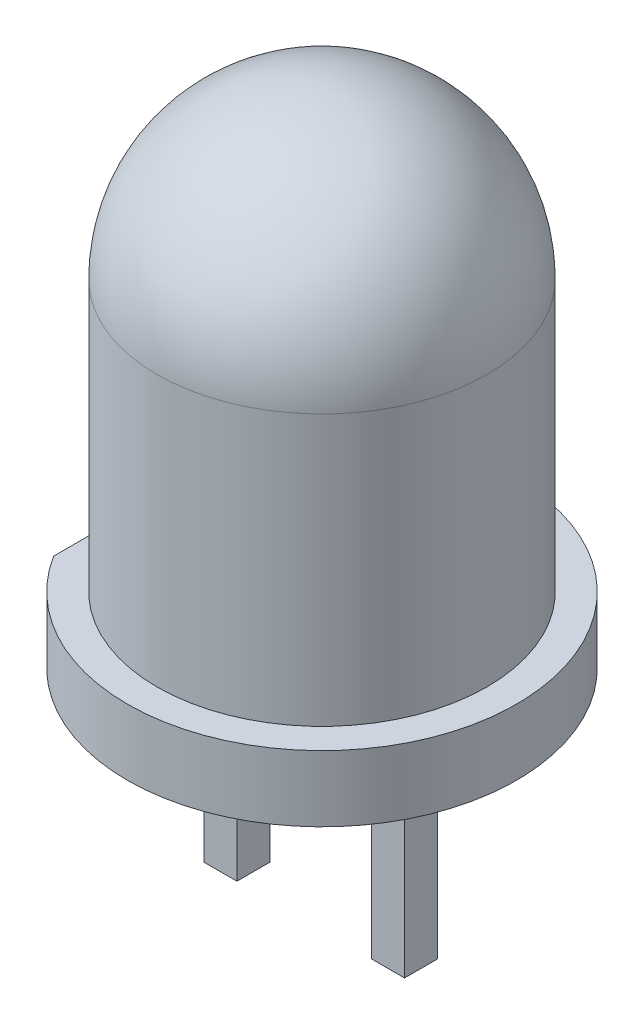
ISO-10303-21;
HEADER;
FILE_DESCRIPTION(('STEP AP214'),'2;1');
FILE_NAME('part.step','',(''),(''),'','','');
FILE_SCHEMA(('AUTOMOTIVE_DESIGN { 1 0 10303 214 1 1 1 1 }'));
ENDSEC;
DATA;
#1=APPLICATION_CONTEXT('core data for automotive mechanical design processes');
#2=APPLICATION_PROTOCOL_DEFINITION('international standard','automotive_design',2000,#1);
#3=PRODUCT_CONTEXT('',#1,'mechanical');
#4=PRODUCT('Part','Part','',(#3));
#5=PRODUCT_RELATED_PRODUCT_CATEGORY('part','',(#4));
#6=PRODUCT_DEFINITION_FORMATION('','',#4);
#7=PRODUCT_DEFINITION_CONTEXT('part definition',#1,'design');
#8=PRODUCT_DEFINITION('design','',#6,#7);
#9=PRODUCT_DEFINITION_SHAPE('','',#8);
#10=(LENGTH_UNIT() NAMED_UNIT(*) SI_UNIT(.MILLI.,.METRE.));
#11=(NAMED_UNIT(*) PLANE_ANGLE_UNIT() SI_UNIT($,.RADIAN.));
#12=(NAMED_UNIT(*) SI_UNIT($,.STERADIAN.) SOLID_ANGLE_UNIT());
#13=UNCERTAINTY_MEASURE_WITH_UNIT(LENGTH_MEASURE(1.E-05),#10,'distance_accuracy_value','');
#14=(GEOMETRIC_REPRESENTATION_CONTEXT(3) GLOBAL_UNCERTAINTY_ASSIGNED_CONTEXT((#13)) GLOBAL_UNIT_ASSIGNED_CONTEXT((#10,
#11,#12)) REPRESENTATION_CONTEXT('',''));
#15=CARTESIAN_POINT('',(0.,0.,0.));
#16=DIRECTION('',(0.,0.,1.));
#17=DIRECTION('',(1.,0.,0.));
#18=AXIS2_PLACEMENT_3D('',#15,#16,#17);
#19=CARTESIAN_POINT('',(0.,-919.589259581909,0.));
#20=DIRECTION('',(0.,-1.,0.));
#21=DIRECTION('',(0.,0.,-1.));
#22=AXIS2_PLACEMENT_3D('',#19,#20,#21);
#23=PLANE('',#22);
#24=DIRECTION('',(0.,0.,1.));
#25=VECTOR('',#24,1.);
#26=CARTESIAN_POINT('',(-2.5,-919.589259581909,0.));
#27=LINE('',#26,#25);
#28=CARTESIAN_POINT('',(-2.5,-919.589259581909,-1.56604597633658));
#29=VERTEX_POINT('',#28);
#30=CARTESIAN_POINT('',(-2.5,-919.589259581909,1.56604597633658));
#31=VERTEX_POINT('',#30);
#32=EDGE_CURVE('E186',#29,#31,#27,.T.);
#33=ORIENTED_EDGE('',*,*,#32,.F.);
#34=CARTESIAN_POINT('',(0.,-919.589259581909,0.));
#35=DIRECTION('',(0.,-1.,0.));
#36=DIRECTION('',(0.,0.,-1.));
#37=AXIS2_PLACEMENT_3D('',#34,#35,#36);
#38=CIRCLE('',#37,2.95);
#39=EDGE_CURVE('E11',#29,#31,#38,.T.);
#40=ORIENTED_EDGE('',*,*,#39,.T.);
#41=EDGE_LOOP('',(#33,#40));
#42=FACE_BOUND('',#41,.T.);
#43=DIRECTION('',(0.,0.,-1.));
#44=VECTOR('',#43,1.);
#45=CARTESIAN_POINT('',(1.02,-919.589259581909,-0.231185998967931));
#46=LINE('',#45,#44);
#47=CARTESIAN_POINT('',(1.02,-919.589259581909,0.268814001032069));
#48=VERTEX_POINT('',#47);
#49=CARTESIAN_POINT('',(1.02,-919.589259581909,-0.231185998967931));
#50=VERTEX_POINT('',#49);
#51=EDGE_CURVE('E146',#48,#50,#46,.T.);
#52=ORIENTED_EDGE('',*,*,#51,.F.);
#53=DIRECTION('',(-1.,0.,0.));
#54=VECTOR('',#53,1.);
#55=CARTESIAN_POINT('',(1.02,-919.589259581909,0.268814001032069));
#56=LINE('',#55,#54);
#57=CARTESIAN_POINT('',(1.52,-919.589259581909,0.268814001032069));
#58=VERTEX_POINT('',#57);
#59=EDGE_CURVE('E143',#58,#48,#56,.T.);
#60=ORIENTED_EDGE('',*,*,#59,.F.);
#61=DIRECTION('',(0.,0.,1.));
#62=VECTOR('',#61,1.);
#63=CARTESIAN_POINT('',(1.52,-919.589259581909,0.268814001032069));
#64=LINE('',#63,#62);
#65=CARTESIAN_POINT('',(1.52,-919.589259581909,-0.231185998967931));
#66=VERTEX_POINT('',#65);
#67=EDGE_CURVE('E152',#66,#58,#64,.T.);
#68=ORIENTED_EDGE('',*,*,#67,.F.);
#69=DIRECTION('',(1.,0.,0.));
#70=VECTOR('',#69,1.);
#71=CARTESIAN_POINT('',(1.52,-919.589259581909,-0.231185998967931));
#72=LINE('',#71,#70);
#73=EDGE_CURVE('E149',#50,#66,#72,.T.);
#74=ORIENTED_EDGE('',*,*,#73,.F.);
#75=EDGE_LOOP('',(#52,#60,#68,#74));
#76=FACE_BOUND('',#75,.T.);
#77=DIRECTION('',(-1.,0.,0.));
#78=VECTOR('',#77,1.);
#79=CARTESIAN_POINT('',(-1.52,-919.589259581909,0.268814001032069));
#80=LINE('',#79,#78);
#81=CARTESIAN_POINT('',(-1.02,-919.589259581909,0.268814001032069));
#82=VERTEX_POINT('',#81);
#83=CARTESIAN_POINT('',(-1.52,-919.589259581909,0.268814001032069));
#84=VERTEX_POINT('',#83);
#85=EDGE_CURVE('E196',#82,#84,#80,.T.);
#86=ORIENTED_EDGE('',*,*,#85,.F.);
#87=DIRECTION('',(0.,0.,1.));
#88=VECTOR('',#87,1.);
#89=CARTESIAN_POINT('',(-1.02,-919.589259581909,0.268814001032069));
#90=LINE('',#89,#88);
#91=CARTESIAN_POINT('',(-1.02,-919.589259581909,-0.231185998967931));
#92=VERTEX_POINT('',#91);
#93=EDGE_CURVE('E194',#92,#82,#90,.T.);
#94=ORIENTED_EDGE('',*,*,#93,.F.);
#95=DIRECTION('',(1.,0.,0.));
#96=VECTOR('',#95,1.);
#97=CARTESIAN_POINT('',(-1.02,-919.589259581909,-0.231185998967931));
#98=LINE('',#97,#96);
#99=CARTESIAN_POINT('',(-1.52,-919.589259581909,-0.231185998967931));
#100=VERTEX_POINT('',#99);
#101=EDGE_CURVE('E131',#100,#92,#98,.T.);
#102=ORIENTED_EDGE('',*,*,#101,.F.);
#103=DIRECTION('',(0.,0.,-1.));
#104=VECTOR('',#103,1.);
#105=CARTESIAN_POINT('',(-1.52,-919.589259581909,-0.231185998967931));
#106=LINE('',#105,#104);
#107=EDGE_CURVE('E137',#84,#100,#106,.T.);
#108=ORIENTED_EDGE('',*,*,#107,.F.);
#109=EDGE_LOOP('',(#86,#94,#102,#108));
#110=FACE_BOUND('',#109,.T.);
#111=ADVANCED_FACE('F34',(#42,#76,#110),#23,.T.);
#112=CARTESIAN_POINT('',(0.,-1491.47163397612,0.));
#113=DIRECTION('',(0.,-1.,0.));
#114=DIRECTION('',(0.,0.,-1.));
#115=AXIS2_PLACEMENT_3D('',#112,#113,#114);
#116=CYLINDRICAL_SURFACE('',#115,2.95);
#117=DIRECTION('',(0.,-1.,0.));
#118=VECTOR('',#117,1.);
#119=CARTESIAN_POINT('',(-2.5,-1491.47163397612,1.56604597633658));
#120=LINE('',#119,#118);
#121=CARTESIAN_POINT('',(-2.5,-918.589259581909,1.56604597633658));
#122=VERTEX_POINT('',#121);
#123=EDGE_CURVE('E175',#31,#122,#120,.F.);
#124=ORIENTED_EDGE('',*,*,#123,.F.);
#125=ORIENTED_EDGE('',*,*,#39,.F.);
#126=DIRECTION('',(0.,-1.,0.));
#127=VECTOR('',#126,1.);
#128=CARTESIAN_POINT('',(-2.5,-1491.47163397612,-1.56604597633658));
#129=LINE('',#128,#127);
#130=CARTESIAN_POINT('',(-2.5,-918.589259581909,-1.56604597633658));
#131=VERTEX_POINT('',#130);
#132=EDGE_CURVE('E176',#131,#29,#129,.T.);
#133=ORIENTED_EDGE('',*,*,#132,.F.);
#134=CARTESIAN_POINT('',(0.,-918.589259581909,0.));
#135=DIRECTION('',(0.,-1.,0.));
#136=DIRECTION('',(0.,0.,-1.));
#137=AXIS2_PLACEMENT_3D('',#134,#135,#136);
#138=CIRCLE('',#137,2.95);
#139=EDGE_CURVE('E41',#131,#122,#138,.T.);
#140=ORIENTED_EDGE('',*,*,#139,.T.);
#141=EDGE_LOOP('',(#124,#125,#133,#140));
#142=FACE_BOUND('',#141,.T.);
#143=ADVANCED_FACE('F173',(#142),#116,.T.);
#144=CARTESIAN_POINT('',(0.,-918.589259581909,-2.95));
#145=DIRECTION('',(0.,1.,0.));
#146=DIRECTION('',(0.,0.,1.));
#147=AXIS2_PLACEMENT_3D('',#144,#145,#146);
#148=PLANE('',#147);
#149=DIRECTION('',(0.,0.,-1.));
#150=VECTOR('',#149,1.);
#151=CARTESIAN_POINT('',(-2.5,-918.589259581909,2.50961933912005));
#152=LINE('',#151,#150);
#153=CARTESIAN_POINT('',(-2.5,-918.589259581909,0.));
#154=VERTEX_POINT('',#153);
#155=EDGE_CURVE('E182',#122,#154,#152,.T.);
#156=ORIENTED_EDGE('',*,*,#155,.F.);
#157=ORIENTED_EDGE('',*,*,#139,.F.);
#158=EDGE_CURVE('E181',#154,#131,#152,.T.);
#159=ORIENTED_EDGE('',*,*,#158,.F.);
#160=CARTESIAN_POINT('',(0.,-918.589259581909,0.));
#161=DIRECTION('',(0.,-1.,0.));
#162=DIRECTION('',(0.,0.,-1.));
#163=AXIS2_PLACEMENT_3D('',#160,#161,#162);
#164=CIRCLE('',#163,2.5);
#165=EDGE_CURVE('E166',#154,#154,#164,.T.);
#166=ORIENTED_EDGE('',*,*,#165,.T.);
#167=EDGE_LOOP('',(#156,#157,#159,#166));
#168=FACE_BOUND('',#167,.T.);
#169=ADVANCED_FACE('F180',(#168),#148,.T.);
#170=CARTESIAN_POINT('',(0.,-1491.47163397612,0.));
#171=DIRECTION('',(0.,-1.,0.));
#172=DIRECTION('',(0.,0.,-1.));
#173=AXIS2_PLACEMENT_3D('',#170,#171,#172);
#174=CYLINDRICAL_SURFACE('',#173,2.5);
#175=CARTESIAN_POINT('',(0.,-914.489259581906,0.));
#176=DIRECTION('',(0.,-1.,0.));
#177=DIRECTION('',(0.,0.,-1.));
#178=AXIS2_PLACEMENT_3D('',#175,#176,#177);
#179=CIRCLE('',#178,2.5);
#180=CARTESIAN_POINT('',(0.,-914.489259581906,-2.5));
#181=VERTEX_POINT('',#180);
#182=EDGE_CURVE('E163',#181,#181,#179,.T.);
#183=ORIENTED_EDGE('',*,*,#182,.T.);
#184=EDGE_LOOP('',(#183));
#185=FACE_BOUND('',#184,.T.);
#186=ORIENTED_EDGE('',*,*,#165,.F.);
#187=EDGE_LOOP('',(#186));
#188=FACE_BOUND('',#187,.T.);
#189=ADVANCED_FACE('F299',(#185,#188),#174,.T.);
#190=CARTESIAN_POINT('',(0.,-914.489259581906,0.));
#191=DIRECTION('',(0.,-1.,0.));
#192=DIRECTION('',(0.,0.,-1.));
#193=AXIS2_PLACEMENT_3D('',#190,#191,#192);
#194=SPHERICAL_SURFACE('',#193,2.49999999999853);
#195=ORIENTED_EDGE('',*,*,#182,.F.);
#196=EDGE_LOOP('',(#195));
#197=FACE_BOUND('',#196,.T.);
#198=ADVANCED_FACE('F308',(#197),#194,.T.);
#199=CARTESIAN_POINT('',(1.02,-944.989259581909,0.268814001032069));
#200=DIRECTION('',(0.,0.,-1.));
#201=DIRECTION('',(-1.,0.,0.));
#202=AXIS2_PLACEMENT_3D('',#199,#200,#201);
#203=PLANE('',#202);
#204=DIRECTION('',(0.,1.,0.));
#205=VECTOR('',#204,1.);
#206=CARTESIAN_POINT('',(1.02,-944.989259581909,0.268814001032069));
#207=LINE('',#206,#205);
#208=CARTESIAN_POINT('',(1.02,-922.764259581909,0.268814001032069));
#209=VERTEX_POINT('',#208);
#210=EDGE_CURVE('E161',#209,#48,#207,.T.);
#211=ORIENTED_EDGE('',*,*,#210,.F.);
#212=DIRECTION('',(1.,0.,0.));
#213=VECTOR('',#212,1.);
#214=CARTESIAN_POINT('',(1.02,-922.764259581909,0.268814001032069));
#215=LINE('',#214,#213);
#216=CARTESIAN_POINT('',(1.52,-922.764259581909,0.268814001032069));
#217=VERTEX_POINT('',#216);
#218=EDGE_CURVE('E188',#209,#217,#215,.T.);
#219=ORIENTED_EDGE('',*,*,#218,.T.);
#220=DIRECTION('',(0.,1.,0.));
#221=VECTOR('',#220,1.);
#222=CARTESIAN_POINT('',(1.52,-944.989259581909,0.268814001032069));
#223=LINE('',#222,#221);
#224=EDGE_CURVE('E155',#217,#58,#223,.T.);
#225=ORIENTED_EDGE('',*,*,#224,.T.);
#226=ORIENTED_EDGE('',*,*,#59,.T.);
#227=EDGE_LOOP('',(#211,#219,#225,#226));
#228=FACE_BOUND('',#227,.T.);
#229=ADVANCED_FACE('F218',(#228),#203,.F.);
#230=CARTESIAN_POINT('',(1.02,-944.989259581909,-0.231185998967931));
#231=DIRECTION('',(1.,0.,0.));
#232=DIRECTION('',(0.,0.,-1.));
#233=AXIS2_PLACEMENT_3D('',#230,#231,#232);
#234=PLANE('',#233);
#235=DIRECTION('',(0.,1.,0.));
#236=VECTOR('',#235,1.);
#237=CARTESIAN_POINT('',(1.02,-944.989259581909,-0.231185998967931));
#238=LINE('',#237,#236);
#239=CARTESIAN_POINT('',(1.02,-922.764259581909,-0.231185998967931));
#240=VERTEX_POINT('',#239);
#241=EDGE_CURVE('E159',#240,#50,#238,.T.);
#242=ORIENTED_EDGE('',*,*,#241,.F.);
#243=DIRECTION('',(0.,0.,1.));
#244=VECTOR('',#243,1.);
#245=CARTESIAN_POINT('',(1.02,-922.764259581909,-0.231185998967931));
#246=LINE('',#245,#244);
#247=EDGE_CURVE('E126',#240,#209,#246,.T.);
#248=ORIENTED_EDGE('',*,*,#247,.T.);
#249=ORIENTED_EDGE('',*,*,#210,.T.);
#250=ORIENTED_EDGE('',*,*,#51,.T.);
#251=EDGE_LOOP('',(#242,#248,#249,#250));
#252=FACE_BOUND('',#251,.T.);
#253=ADVANCED_FACE('F227',(#252),#234,.F.);
#254=CARTESIAN_POINT('',(1.52,-944.989259581909,-0.231185998967931));
#255=DIRECTION('',(0.,0.,1.));
#256=DIRECTION('',(1.,0.,0.));
#257=AXIS2_PLACEMENT_3D('',#254,#255,#256);
#258=PLANE('',#257);
#259=DIRECTION('',(0.,1.,0.));
#260=VECTOR('',#259,1.);
#261=CARTESIAN_POINT('',(1.52,-944.989259581909,-0.231185998967931));
#262=LINE('',#261,#260);
#263=CARTESIAN_POINT('',(1.52,-922.764259581909,-0.231185998967931));
#264=VERTEX_POINT('',#263);
#265=EDGE_CURVE('E157',#264,#66,#262,.T.);
#266=ORIENTED_EDGE('',*,*,#265,.F.);
#267=DIRECTION('',(1.,0.,0.));
#268=VECTOR('',#267,1.);
#269=CARTESIAN_POINT('',(-1.52,-922.764259581909,-0.231185998967931));
#270=LINE('',#269,#268);
#271=EDGE_CURVE('E48',#240,#264,#270,.T.);
#272=ORIENTED_EDGE('',*,*,#271,.F.);
#273=ORIENTED_EDGE('',*,*,#241,.T.);
#274=ORIENTED_EDGE('',*,*,#73,.T.);
#275=EDGE_LOOP('',(#266,#272,#273,#274));
#276=FACE_BOUND('',#275,.T.);
#277=ADVANCED_FACE('F229',(#276),#258,.F.);
#278=CARTESIAN_POINT('',(1.52,-944.989259581909,0.268814001032069));
#279=DIRECTION('',(-1.,0.,0.));
#280=DIRECTION('',(0.,0.,1.));
#281=AXIS2_PLACEMENT_3D('',#278,#279,#280);
#282=PLANE('',#281);
#283=ORIENTED_EDGE('',*,*,#224,.F.);
#284=DIRECTION('',(0.,0.,-1.));
#285=VECTOR('',#284,1.);
#286=CARTESIAN_POINT('',(1.52,-922.764259581909,2.95));
#287=LINE('',#286,#285);
#288=EDGE_CURVE('E207',#217,#264,#287,.T.);
#289=ORIENTED_EDGE('',*,*,#288,.T.);
#290=ORIENTED_EDGE('',*,*,#265,.T.);
#291=ORIENTED_EDGE('',*,*,#67,.T.);
#292=EDGE_LOOP('',(#283,#289,#290,#291));
#293=FACE_BOUND('',#292,.T.);
#294=ADVANCED_FACE('F220',(#293),#282,.F.);
#295=CARTESIAN_POINT('',(-1.02,-944.989259581909,0.268814001032069));
#296=DIRECTION('',(-1.,0.,0.));
#297=DIRECTION('',(0.,0.,1.));
#298=AXIS2_PLACEMENT_3D('',#295,#296,#297);
#299=PLANE('',#298);
#300=DIRECTION('',(0.,1.,0.));
#301=VECTOR('',#300,1.);
#302=CARTESIAN_POINT('',(-1.02,-944.989259581909,0.268814001032069));
#303=LINE('',#302,#301);
#304=CARTESIAN_POINT('',(-1.02,-922.764259581909,0.268814001032069));
#305=VERTEX_POINT('',#304);
#306=EDGE_CURVE('E125',#305,#82,#303,.T.);
#307=ORIENTED_EDGE('',*,*,#306,.F.);
#308=DIRECTION('',(0.,0.,-1.));
#309=VECTOR('',#308,1.);
#310=CARTESIAN_POINT('',(-1.02,-922.764259581909,0.268814001032069));
#311=LINE('',#310,#309);
#312=CARTESIAN_POINT('',(-1.02,-922.764259581909,-0.231185998967931));
#313=VERTEX_POINT('',#312);
#314=EDGE_CURVE('E113',#305,#313,#311,.T.);
#315=ORIENTED_EDGE('',*,*,#314,.T.);
#316=DIRECTION('',(0.,1.,0.));
#317=VECTOR('',#316,1.);
#318=CARTESIAN_POINT('',(-1.02,-944.989259581909,-0.231185998967931));
#319=LINE('',#318,#317);
#320=EDGE_CURVE('E123',#313,#92,#319,.T.);
#321=ORIENTED_EDGE('',*,*,#320,.T.);
#322=ORIENTED_EDGE('',*,*,#93,.T.);
#323=EDGE_LOOP('',(#307,#315,#321,#322));
#324=FACE_BOUND('',#323,.T.);
#325=ADVANCED_FACE('F121',(#324),#299,.F.);
#326=CARTESIAN_POINT('',(-1.52,-944.989259581909,0.268814001032069));
#327=DIRECTION('',(0.,0.,-1.));
#328=DIRECTION('',(-1.,0.,0.));
#329=AXIS2_PLACEMENT_3D('',#326,#327,#328);
#330=PLANE('',#329);
#331=DIRECTION('',(0.,1.,0.));
#332=VECTOR('',#331,1.);
#333=CARTESIAN_POINT('',(-1.52,-944.989259581909,0.268814001032069));
#334=LINE('',#333,#332);
#335=CARTESIAN_POINT('',(-1.52,-922.764259581909,0.268814001032069));
#336=VERTEX_POINT('',#335);
#337=EDGE_CURVE('E135',#336,#84,#334,.T.);
#338=ORIENTED_EDGE('',*,*,#337,.F.);
#339=DIRECTION('',(1.,0.,0.));
#340=VECTOR('',#339,1.);
#341=CARTESIAN_POINT('',(-1.52,-922.764259581909,0.268814001032069));
#342=LINE('',#341,#340);
#343=EDGE_CURVE('E127',#336,#305,#342,.T.);
#344=ORIENTED_EDGE('',*,*,#343,.T.);
#345=ORIENTED_EDGE('',*,*,#306,.T.);
#346=ORIENTED_EDGE('',*,*,#85,.T.);
#347=EDGE_LOOP('',(#338,#344,#345,#346));
#348=FACE_BOUND('',#347,.T.);
#349=ADVANCED_FACE('F206',(#348),#330,.F.);
#350=CARTESIAN_POINT('',(-1.52,-944.989259581909,-0.231185998967931));
#351=DIRECTION('',(1.,0.,0.));
#352=DIRECTION('',(0.,0.,-1.));
#353=AXIS2_PLACEMENT_3D('',#350,#351,#352);
#354=PLANE('',#353);
#355=DIRECTION('',(0.,1.,0.));
#356=VECTOR('',#355,1.);
#357=CARTESIAN_POINT('',(-1.52,-944.989259581909,-0.231185998967931));
#358=LINE('',#357,#356);
#359=CARTESIAN_POINT('',(-1.52,-922.764259581909,-0.231185998967931));
#360=VERTEX_POINT('',#359);
#361=EDGE_CURVE('E133',#360,#100,#358,.T.);
#362=ORIENTED_EDGE('',*,*,#361,.F.);
#363=DIRECTION('',(0.,0.,-1.));
#364=VECTOR('',#363,1.);
#365=CARTESIAN_POINT('',(-1.52,-922.764259581909,2.95));
#366=LINE('',#365,#364);
#367=EDGE_CURVE('E56',#336,#360,#366,.T.);
#368=ORIENTED_EDGE('',*,*,#367,.F.);
#369=ORIENTED_EDGE('',*,*,#337,.T.);
#370=ORIENTED_EDGE('',*,*,#107,.T.);
#371=EDGE_LOOP('',(#362,#368,#369,#370));
#372=FACE_BOUND('',#371,.T.);
#373=ADVANCED_FACE('F201',(#372),#354,.F.);
#374=CARTESIAN_POINT('',(-1.02,-944.989259581909,-0.231185998967931));
#375=DIRECTION('',(0.,0.,1.));
#376=DIRECTION('',(1.,0.,0.));
#377=AXIS2_PLACEMENT_3D('',#374,#375,#376);
#378=PLANE('',#377);
#379=ORIENTED_EDGE('',*,*,#320,.F.);
#380=EDGE_CURVE('E110',#360,#313,#270,.T.);
#381=ORIENTED_EDGE('',*,*,#380,.F.);
#382=ORIENTED_EDGE('',*,*,#361,.T.);
#383=ORIENTED_EDGE('',*,*,#101,.T.);
#384=EDGE_LOOP('',(#379,#381,#382,#383));
#385=FACE_BOUND('',#384,.T.);
#386=ADVANCED_FACE('F129',(#385),#378,.F.);
#387=CARTESIAN_POINT('',(-2.5,-943.989259581909,2.50961933912005));
#388=DIRECTION('',(1.,0.,0.));
#389=DIRECTION('',(0.,0.,-1.));
#390=AXIS2_PLACEMENT_3D('',#387,#388,#389);
#391=PLANE('',#390);
#392=ORIENTED_EDGE('',*,*,#123,.T.);
#393=ORIENTED_EDGE('',*,*,#155,.T.);
#394=ORIENTED_EDGE('',*,*,#158,.T.);
#395=ORIENTED_EDGE('',*,*,#132,.T.);
#396=ORIENTED_EDGE('',*,*,#32,.T.);
#397=EDGE_LOOP('',(#392,#393,#394,#395,#396));
#398=FACE_BOUND('',#397,.T.);
#399=ADVANCED_FACE('F244',(#398),#391,.F.);
#400=CARTESIAN_POINT('',(-1.52,-922.764259581909,2.95));
#401=DIRECTION('',(0.,1.,0.));
#402=DIRECTION('',(0.,0.,1.));
#403=AXIS2_PLACEMENT_3D('',#400,#401,#402);
#404=PLANE('',#403);
#405=ORIENTED_EDGE('',*,*,#343,.F.);
#406=ORIENTED_EDGE('',*,*,#367,.T.);
#407=ORIENTED_EDGE('',*,*,#380,.T.);
#408=ORIENTED_EDGE('',*,*,#314,.F.);
#409=EDGE_LOOP('',(#405,#406,#407,#408));
#410=FACE_BOUND('',#409,.T.);
#411=ADVANCED_FACE('F112',(#410),#404,.F.);
#412=ORIENTED_EDGE('',*,*,#247,.F.);
#413=ORIENTED_EDGE('',*,*,#271,.T.);
#414=ORIENTED_EDGE('',*,*,#288,.F.);
#415=ORIENTED_EDGE('',*,*,#218,.F.);
#416=EDGE_LOOP('',(#412,#413,#414,#415));
#417=FACE_BOUND('',#416,.T.);
#418=ADVANCED_FACE('F251',(#417),#404,.F.);
#419=CLOSED_SHELL('',(#111,#143,#169,#189,#198,#229,#253,#277,#294,#325,#349,#373,#386,#399,
#411,#418));
#420=MANIFOLD_SOLID_BREP('B2',#419);
#421=ADVANCED_BREP_SHAPE_REPRESENTATION('',(#18,#420),#14);
#422=SHAPE_DEFINITION_REPRESENTATION(#9,#421);
ENDSEC;
END-ISO-10303-21;
